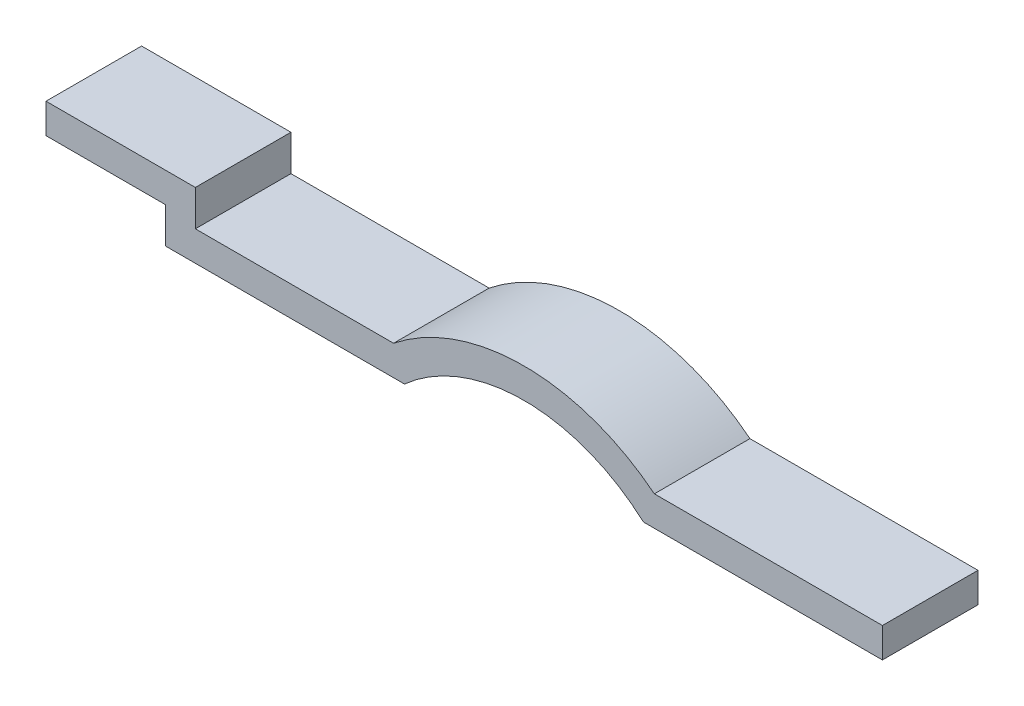
ISO-10303-21;
HEADER;
FILE_DESCRIPTION(('STEP AP214'),'2;1');
FILE_NAME('part.step','',(''),(''),'','','');
FILE_SCHEMA(('AUTOMOTIVE_DESIGN { 1 0 10303 214 1 1 1 1 }'));
ENDSEC;
DATA;
#1=APPLICATION_CONTEXT('core data for automotive mechanical design processes');
#2=APPLICATION_PROTOCOL_DEFINITION('international standard','automotive_design',2000,#1);
#3=PRODUCT_CONTEXT('',#1,'mechanical');
#4=PRODUCT('Part','Part','',(#3));
#5=PRODUCT_RELATED_PRODUCT_CATEGORY('part','',(#4));
#6=PRODUCT_DEFINITION_FORMATION('','',#4);
#7=PRODUCT_DEFINITION_CONTEXT('part definition',#1,'design');
#8=PRODUCT_DEFINITION('design','',#6,#7);
#9=PRODUCT_DEFINITION_SHAPE('','',#8);
#10=(LENGTH_UNIT() NAMED_UNIT(*) SI_UNIT(.MILLI.,.METRE.));
#11=(NAMED_UNIT(*) PLANE_ANGLE_UNIT() SI_UNIT($,.RADIAN.));
#12=(NAMED_UNIT(*) SI_UNIT($,.STERADIAN.) SOLID_ANGLE_UNIT());
#13=UNCERTAINTY_MEASURE_WITH_UNIT(LENGTH_MEASURE(1.E-05),#10,'distance_accuracy_value','');
#14=(GEOMETRIC_REPRESENTATION_CONTEXT(3) GLOBAL_UNCERTAINTY_ASSIGNED_CONTEXT((#13)) GLOBAL_UNIT_ASSIGNED_CONTEXT((#10,
#11,#12)) REPRESENTATION_CONTEXT('',''));
#15=CARTESIAN_POINT('',(0.,0.,0.));
#16=DIRECTION('',(0.,0.,1.));
#17=DIRECTION('',(1.,0.,0.));
#18=AXIS2_PLACEMENT_3D('',#15,#16,#17);
#19=CARTESIAN_POINT('',(0.,25.,80.));
#20=DIRECTION('',(-1.,0.,0.));
#21=DIRECTION('',(0.,-1.,0.));
#22=AXIS2_PLACEMENT_3D('',#19,#20,#21);
#23=PLANE('',#22);
#24=DIRECTION('',(0.,1.,0.));
#25=VECTOR('',#24,1.);
#26=CARTESIAN_POINT('',(0.,25.,0.));
#27=LINE('',#26,#25);
#28=CARTESIAN_POINT('',(0.,0.,0.));
#29=VERTEX_POINT('',#28);
#30=CARTESIAN_POINT('',(0.,25.,0.));
#31=VERTEX_POINT('',#30);
#32=EDGE_CURVE('E161',#29,#31,#27,.T.);
#33=ORIENTED_EDGE('',*,*,#32,.T.);
#34=DIRECTION('',(0.,0.,-1.));
#35=VECTOR('',#34,1.);
#36=CARTESIAN_POINT('',(0.,25.,80.));
#37=LINE('',#36,#35);
#38=CARTESIAN_POINT('',(0.,25.,80.));
#39=VERTEX_POINT('',#38);
#40=EDGE_CURVE('E11',#39,#31,#37,.T.);
#41=ORIENTED_EDGE('',*,*,#40,.F.);
#42=DIRECTION('',(0.,1.,0.));
#43=VECTOR('',#42,1.);
#44=CARTESIAN_POINT('',(0.,25.,80.));
#45=LINE('',#44,#43);
#46=CARTESIAN_POINT('',(0.,0.,80.));
#47=VERTEX_POINT('',#46);
#48=EDGE_CURVE('E183',#47,#39,#45,.T.);
#49=ORIENTED_EDGE('',*,*,#48,.F.);
#50=DIRECTION('',(0.,0.,-1.));
#51=VECTOR('',#50,1.);
#52=CARTESIAN_POINT('',(0.,0.,80.));
#53=LINE('',#52,#51);
#54=EDGE_CURVE('E157',#47,#29,#53,.T.);
#55=ORIENTED_EDGE('',*,*,#54,.T.);
#56=EDGE_LOOP('',(#33,#41,#49,#55));
#57=FACE_BOUND('',#56,.T.);
#58=ADVANCED_FACE('F41',(#57),#23,.F.);
#59=CARTESIAN_POINT('',(0.,25.,80.));
#60=DIRECTION('',(0.,-1.,0.));
#61=DIRECTION('',(1.,0.,0.));
#62=AXIS2_PLACEMENT_3D('',#59,#60,#61);
#63=PLANE('',#62);
#64=DIRECTION('',(-1.,0.,0.));
#65=VECTOR('',#64,1.);
#66=CARTESIAN_POINT('',(0.,25.,0.));
#67=LINE('',#66,#65);
#68=CARTESIAN_POINT('',(-190.867832165532,25.,0.));
#69=VERTEX_POINT('',#68);
#70=EDGE_CURVE('E164',#31,#69,#67,.T.);
#71=ORIENTED_EDGE('',*,*,#70,.T.);
#72=DIRECTION('',(0.,0.,-1.));
#73=VECTOR('',#72,1.);
#74=CARTESIAN_POINT('',(-190.867832165532,25.,80.));
#75=LINE('',#74,#73);
#76=CARTESIAN_POINT('',(-190.867832165532,25.,80.));
#77=VERTEX_POINT('',#76);
#78=EDGE_CURVE('E49',#77,#69,#75,.T.);
#79=ORIENTED_EDGE('',*,*,#78,.F.);
#80=DIRECTION('',(-1.,0.,0.));
#81=VECTOR('',#80,1.);
#82=CARTESIAN_POINT('',(0.,25.,80.));
#83=LINE('',#82,#81);
#84=EDGE_CURVE('E112',#39,#77,#83,.T.);
#85=ORIENTED_EDGE('',*,*,#84,.F.);
#86=ORIENTED_EDGE('',*,*,#40,.T.);
#87=EDGE_LOOP('',(#71,#79,#85,#86));
#88=FACE_BOUND('',#87,.T.);
#89=ADVANCED_FACE('F261',(#88),#63,.F.);
#90=CARTESIAN_POINT('',(-300.,-111.803398874989,80.));
#91=DIRECTION('',(0.,0.,-1.));
#92=DIRECTION('',(-1.,0.,0.));
#93=AXIS2_PLACEMENT_3D('',#90,#91,#92);
#94=CYLINDRICAL_SURFACE('',#93,175.);
#95=CARTESIAN_POINT('',(-300.,-111.803398874989,0.));
#96=DIRECTION('',(0.,0.,1.));
#97=DIRECTION('',(-1.,0.,0.));
#98=AXIS2_PLACEMENT_3D('',#95,#96,#97);
#99=CIRCLE('',#98,175.);
#100=CARTESIAN_POINT('',(-409.132167834468,25.,0.));
#101=VERTEX_POINT('',#100);
#102=EDGE_CURVE('E166',#69,#101,#99,.T.);
#103=ORIENTED_EDGE('',*,*,#102,.T.);
#104=DIRECTION('',(0.,0.,-1.));
#105=VECTOR('',#104,1.);
#106=CARTESIAN_POINT('',(-409.132167834468,25.,80.));
#107=LINE('',#106,#105);
#108=CARTESIAN_POINT('',(-409.132167834468,25.,80.));
#109=VERTEX_POINT('',#108);
#110=EDGE_CURVE('E202',#109,#101,#107,.T.);
#111=ORIENTED_EDGE('',*,*,#110,.F.);
#112=CARTESIAN_POINT('',(-300.,-111.803398874989,80.));
#113=DIRECTION('',(0.,0.,1.));
#114=DIRECTION('',(-1.,0.,0.));
#115=AXIS2_PLACEMENT_3D('',#112,#113,#114);
#116=CIRCLE('',#115,175.);
#117=EDGE_CURVE('E210',#77,#109,#116,.T.);
#118=ORIENTED_EDGE('',*,*,#117,.F.);
#119=ORIENTED_EDGE('',*,*,#78,.T.);
#120=EDGE_LOOP('',(#103,#111,#118,#119));
#121=FACE_BOUND('',#120,.T.);
#122=ADVANCED_FACE('F208',(#121),#94,.T.);
#123=CARTESIAN_POINT('',(-409.132167834468,25.,80.));
#124=DIRECTION('',(0.,-1.,0.));
#125=DIRECTION('',(1.,0.,0.));
#126=AXIS2_PLACEMENT_3D('',#123,#124,#125);
#127=PLANE('',#126);
#128=DIRECTION('',(-1.,0.,0.));
#129=VECTOR('',#128,1.);
#130=CARTESIAN_POINT('',(-409.132167834468,25.,0.));
#131=LINE('',#130,#129);
#132=CARTESIAN_POINT('',(-575.,25.,0.));
#133=VERTEX_POINT('',#132);
#134=EDGE_CURVE('E168',#101,#133,#131,.T.);
#135=ORIENTED_EDGE('',*,*,#134,.T.);
#136=DIRECTION('',(0.,0.,-1.));
#137=VECTOR('',#136,1.);
#138=CARTESIAN_POINT('',(-575.,25.,80.));
#139=LINE('',#138,#137);
#140=CARTESIAN_POINT('',(-575.,25.,80.));
#141=VERTEX_POINT('',#140);
#142=EDGE_CURVE('E199',#141,#133,#139,.T.);
#143=ORIENTED_EDGE('',*,*,#142,.F.);
#144=DIRECTION('',(-1.,0.,0.));
#145=VECTOR('',#144,1.);
#146=CARTESIAN_POINT('',(-409.132167834468,25.,80.));
#147=LINE('',#146,#145);
#148=EDGE_CURVE('E228',#109,#141,#147,.T.);
#149=ORIENTED_EDGE('',*,*,#148,.F.);
#150=ORIENTED_EDGE('',*,*,#110,.T.);
#151=EDGE_LOOP('',(#135,#143,#149,#150));
#152=FACE_BOUND('',#151,.T.);
#153=ADVANCED_FACE('F219',(#152),#127,.F.);
#154=CARTESIAN_POINT('',(-575.,25.,80.));
#155=DIRECTION('',(-1.,0.,0.));
#156=DIRECTION('',(0.,0.,1.));
#157=AXIS2_PLACEMENT_3D('',#154,#155,#156);
#158=PLANE('',#157);
#159=DIRECTION('',(0.,1.,0.));
#160=VECTOR('',#159,1.);
#161=CARTESIAN_POINT('',(-575.,25.,0.));
#162=LINE('',#161,#160);
#163=CARTESIAN_POINT('',(-575.,55.,0.));
#164=VERTEX_POINT('',#163);
#165=EDGE_CURVE('E170',#133,#164,#162,.T.);
#166=ORIENTED_EDGE('',*,*,#165,.T.);
#167=DIRECTION('',(0.,0.,-1.));
#168=VECTOR('',#167,1.);
#169=CARTESIAN_POINT('',(-575.,55.,80.));
#170=LINE('',#169,#168);
#171=CARTESIAN_POINT('',(-575.,55.,80.));
#172=VERTEX_POINT('',#171);
#173=EDGE_CURVE('E196',#172,#164,#170,.T.);
#174=ORIENTED_EDGE('',*,*,#173,.F.);
#175=DIRECTION('',(0.,1.,0.));
#176=VECTOR('',#175,1.);
#177=CARTESIAN_POINT('',(-575.,25.,80.));
#178=LINE('',#177,#176);
#179=EDGE_CURVE('E225',#141,#172,#178,.T.);
#180=ORIENTED_EDGE('',*,*,#179,.F.);
#181=ORIENTED_EDGE('',*,*,#142,.T.);
#182=EDGE_LOOP('',(#166,#174,#180,#181));
#183=FACE_BOUND('',#182,.T.);
#184=ADVANCED_FACE('F223',(#183),#158,.F.);
#185=CARTESIAN_POINT('',(-575.,55.,80.));
#186=DIRECTION('',(0.,-1.,0.));
#187=DIRECTION('',(1.,0.,0.));
#188=AXIS2_PLACEMENT_3D('',#185,#186,#187);
#189=PLANE('',#188);
#190=DIRECTION('',(-1.,0.,0.));
#191=VECTOR('',#190,1.);
#192=CARTESIAN_POINT('',(-575.,55.,0.));
#193=LINE('',#192,#191);
#194=CARTESIAN_POINT('',(-700.,55.,0.));
#195=VERTEX_POINT('',#194);
#196=EDGE_CURVE('E172',#164,#195,#193,.T.);
#197=ORIENTED_EDGE('',*,*,#196,.T.);
#198=DIRECTION('',(0.,0.,-1.));
#199=VECTOR('',#198,1.);
#200=CARTESIAN_POINT('',(-700.,55.,80.));
#201=LINE('',#200,#199);
#202=CARTESIAN_POINT('',(-700.,55.,80.));
#203=VERTEX_POINT('',#202);
#204=EDGE_CURVE('E193',#203,#195,#201,.T.);
#205=ORIENTED_EDGE('',*,*,#204,.F.);
#206=DIRECTION('',(-1.,0.,0.));
#207=VECTOR('',#206,1.);
#208=CARTESIAN_POINT('',(-575.,55.,80.));
#209=LINE('',#208,#207);
#210=EDGE_CURVE('E227',#172,#203,#209,.T.);
#211=ORIENTED_EDGE('',*,*,#210,.F.);
#212=ORIENTED_EDGE('',*,*,#173,.T.);
#213=EDGE_LOOP('',(#197,#205,#211,#212));
#214=FACE_BOUND('',#213,.T.);
#215=ADVANCED_FACE('F274',(#214),#189,.F.);
#216=CARTESIAN_POINT('',(-700.,30.,80.));
#217=DIRECTION('',(1.,0.,0.));
#218=DIRECTION('',(0.,0.,-1.));
#219=AXIS2_PLACEMENT_3D('',#216,#217,#218);
#220=PLANE('',#219);
#221=DIRECTION('',(0.,-1.,0.));
#222=VECTOR('',#221,1.);
#223=CARTESIAN_POINT('',(-700.,30.,0.));
#224=LINE('',#223,#222);
#225=CARTESIAN_POINT('',(-700.,30.,0.));
#226=VERTEX_POINT('',#225);
#227=EDGE_CURVE('E174',#195,#226,#224,.T.);
#228=ORIENTED_EDGE('',*,*,#227,.T.);
#229=DIRECTION('',(0.,0.,-1.));
#230=VECTOR('',#229,1.);
#231=CARTESIAN_POINT('',(-700.,30.,80.));
#232=LINE('',#231,#230);
#233=CARTESIAN_POINT('',(-700.,30.,80.));
#234=VERTEX_POINT('',#233);
#235=EDGE_CURVE('E190',#234,#226,#232,.T.);
#236=ORIENTED_EDGE('',*,*,#235,.F.);
#237=DIRECTION('',(0.,-1.,0.));
#238=VECTOR('',#237,1.);
#239=CARTESIAN_POINT('',(-700.,30.,80.));
#240=LINE('',#239,#238);
#241=EDGE_CURVE('E230',#203,#234,#240,.T.);
#242=ORIENTED_EDGE('',*,*,#241,.F.);
#243=ORIENTED_EDGE('',*,*,#204,.T.);
#244=EDGE_LOOP('',(#228,#236,#242,#243));
#245=FACE_BOUND('',#244,.T.);
#246=ADVANCED_FACE('F277',(#245),#220,.F.);
#247=CARTESIAN_POINT('',(-600.,30.,80.));
#248=DIRECTION('',(0.,1.,0.));
#249=DIRECTION('',(-1.,0.,0.));
#250=AXIS2_PLACEMENT_3D('',#247,#248,#249);
#251=PLANE('',#250);
#252=DIRECTION('',(1.,0.,0.));
#253=VECTOR('',#252,1.);
#254=CARTESIAN_POINT('',(-600.,30.,0.));
#255=LINE('',#254,#253);
#256=CARTESIAN_POINT('',(-600.,30.,0.));
#257=VERTEX_POINT('',#256);
#258=EDGE_CURVE('E176',#226,#257,#255,.T.);
#259=ORIENTED_EDGE('',*,*,#258,.T.);
#260=DIRECTION('',(0.,0.,-1.));
#261=VECTOR('',#260,1.);
#262=CARTESIAN_POINT('',(-600.,30.,80.));
#263=LINE('',#262,#261);
#264=CARTESIAN_POINT('',(-600.,30.,80.));
#265=VERTEX_POINT('',#264);
#266=EDGE_CURVE('E187',#265,#257,#263,.T.);
#267=ORIENTED_EDGE('',*,*,#266,.F.);
#268=DIRECTION('',(1.,0.,0.));
#269=VECTOR('',#268,1.);
#270=CARTESIAN_POINT('',(-600.,30.,80.));
#271=LINE('',#270,#269);
#272=EDGE_CURVE('E236',#234,#265,#271,.T.);
#273=ORIENTED_EDGE('',*,*,#272,.F.);
#274=ORIENTED_EDGE('',*,*,#235,.T.);
#275=EDGE_LOOP('',(#259,#267,#273,#274));
#276=FACE_BOUND('',#275,.T.);
#277=ADVANCED_FACE('F242',(#276),#251,.F.);
#278=CARTESIAN_POINT('',(-600.,0.,80.));
#279=DIRECTION('',(1.,0.,0.));
#280=DIRECTION('',(0.,0.,-1.));
#281=AXIS2_PLACEMENT_3D('',#278,#279,#280);
#282=PLANE('',#281);
#283=DIRECTION('',(0.,-1.,0.));
#284=VECTOR('',#283,1.);
#285=CARTESIAN_POINT('',(-600.,0.,0.));
#286=LINE('',#285,#284);
#287=CARTESIAN_POINT('',(-600.,0.,0.));
#288=VERTEX_POINT('',#287);
#289=EDGE_CURVE('E178',#257,#288,#286,.T.);
#290=ORIENTED_EDGE('',*,*,#289,.T.);
#291=DIRECTION('',(0.,0.,-1.));
#292=VECTOR('',#291,1.);
#293=CARTESIAN_POINT('',(-600.,0.,80.));
#294=LINE('',#293,#292);
#295=CARTESIAN_POINT('',(-600.,0.,80.));
#296=VERTEX_POINT('',#295);
#297=EDGE_CURVE('E152',#296,#288,#294,.T.);
#298=ORIENTED_EDGE('',*,*,#297,.F.);
#299=DIRECTION('',(0.,-1.,0.));
#300=VECTOR('',#299,1.);
#301=CARTESIAN_POINT('',(-600.,0.,80.));
#302=LINE('',#301,#300);
#303=EDGE_CURVE('E143',#265,#296,#302,.T.);
#304=ORIENTED_EDGE('',*,*,#303,.F.);
#305=ORIENTED_EDGE('',*,*,#266,.T.);
#306=EDGE_LOOP('',(#290,#298,#304,#305));
#307=FACE_BOUND('',#306,.T.);
#308=ADVANCED_FACE('F246',(#307),#282,.F.);
#309=CARTESIAN_POINT('',(-400.,0.,80.));
#310=DIRECTION('',(0.,1.,0.));
#311=DIRECTION('',(-1.,0.,0.));
#312=AXIS2_PLACEMENT_3D('',#309,#310,#311);
#313=PLANE('',#312);
#314=DIRECTION('',(1.,0.,0.));
#315=VECTOR('',#314,1.);
#316=CARTESIAN_POINT('',(-400.,0.,0.));
#317=LINE('',#316,#315);
#318=CARTESIAN_POINT('',(-400.,0.,0.));
#319=VERTEX_POINT('',#318);
#320=EDGE_CURVE('E151',#288,#319,#317,.T.);
#321=ORIENTED_EDGE('',*,*,#320,.T.);
#322=DIRECTION('',(0.,0.,-1.));
#323=VECTOR('',#322,1.);
#324=CARTESIAN_POINT('',(-400.,0.,80.));
#325=LINE('',#324,#323);
#326=CARTESIAN_POINT('',(-400.,0.,80.));
#327=VERTEX_POINT('',#326);
#328=EDGE_CURVE('E148',#327,#319,#325,.T.);
#329=ORIENTED_EDGE('',*,*,#328,.F.);
#330=DIRECTION('',(1.,0.,0.));
#331=VECTOR('',#330,1.);
#332=CARTESIAN_POINT('',(-400.,0.,80.));
#333=LINE('',#332,#331);
#334=EDGE_CURVE('E137',#296,#327,#333,.T.);
#335=ORIENTED_EDGE('',*,*,#334,.F.);
#336=ORIENTED_EDGE('',*,*,#297,.T.);
#337=EDGE_LOOP('',(#321,#329,#335,#336));
#338=FACE_BOUND('',#337,.T.);
#339=ADVANCED_FACE('F149',(#338),#313,.F.);
#340=CARTESIAN_POINT('',(-300.,-111.803398874989,80.));
#341=DIRECTION('',(0.,0.,-1.));
#342=DIRECTION('',(-1.,0.,0.));
#343=AXIS2_PLACEMENT_3D('',#340,#341,#342);
#344=CYLINDRICAL_SURFACE('',#343,150.);
#345=CARTESIAN_POINT('',(-300.,-111.803398874989,0.));
#346=DIRECTION('',(0.,0.,-1.));
#347=DIRECTION('',(-1.,0.,0.));
#348=AXIS2_PLACEMENT_3D('',#345,#346,#347);
#349=CIRCLE('',#348,150.);
#350=CARTESIAN_POINT('',(-200.,0.,0.));
#351=VERTEX_POINT('',#350);
#352=EDGE_CURVE('E98',#319,#351,#349,.T.);
#353=ORIENTED_EDGE('',*,*,#352,.T.);
#354=DIRECTION('',(0.,0.,-1.));
#355=VECTOR('',#354,1.);
#356=CARTESIAN_POINT('',(-200.,0.,80.));
#357=LINE('',#356,#355);
#358=CARTESIAN_POINT('',(-200.,0.,80.));
#359=VERTEX_POINT('',#358);
#360=EDGE_CURVE('E153',#359,#351,#357,.T.);
#361=ORIENTED_EDGE('',*,*,#360,.F.);
#362=CARTESIAN_POINT('',(-300.,-111.803398874989,80.));
#363=DIRECTION('',(0.,0.,-1.));
#364=DIRECTION('',(-1.,0.,0.));
#365=AXIS2_PLACEMENT_3D('',#362,#363,#364);
#366=CIRCLE('',#365,150.);
#367=EDGE_CURVE('E141',#327,#359,#366,.T.);
#368=ORIENTED_EDGE('',*,*,#367,.F.);
#369=ORIENTED_EDGE('',*,*,#328,.T.);
#370=EDGE_LOOP('',(#353,#361,#368,#369));
#371=FACE_BOUND('',#370,.T.);
#372=ADVANCED_FACE('F155',(#371),#344,.F.);
#373=CARTESIAN_POINT('',(0.,0.,80.));
#374=DIRECTION('',(0.,1.,0.));
#375=DIRECTION('',(0.,0.,1.));
#376=AXIS2_PLACEMENT_3D('',#373,#374,#375);
#377=PLANE('',#376);
#378=DIRECTION('',(1.,0.,0.));
#379=VECTOR('',#378,1.);
#380=CARTESIAN_POINT('',(0.,0.,0.));
#381=LINE('',#380,#379);
#382=EDGE_CURVE('E104',#351,#29,#381,.T.);
#383=ORIENTED_EDGE('',*,*,#382,.T.);
#384=ORIENTED_EDGE('',*,*,#54,.F.);
#385=DIRECTION('',(1.,0.,0.));
#386=VECTOR('',#385,1.);
#387=CARTESIAN_POINT('',(0.,0.,80.));
#388=LINE('',#387,#386);
#389=EDGE_CURVE('E57',#359,#47,#388,.T.);
#390=ORIENTED_EDGE('',*,*,#389,.F.);
#391=ORIENTED_EDGE('',*,*,#360,.T.);
#392=EDGE_LOOP('',(#383,#384,#390,#391));
#393=FACE_BOUND('',#392,.T.);
#394=ADVANCED_FACE('F250',(#393),#377,.F.);
#395=CARTESIAN_POINT('',(-300.,-111.803398874989,80.));
#396=DIRECTION('',(0.,0.,-1.));
#397=DIRECTION('',(-1.,0.,0.));
#398=AXIS2_PLACEMENT_3D('',#395,#396,#397);
#399=PLANE('',#398);
#400=ORIENTED_EDGE('',*,*,#48,.T.);
#401=ORIENTED_EDGE('',*,*,#84,.T.);
#402=ORIENTED_EDGE('',*,*,#117,.T.);
#403=ORIENTED_EDGE('',*,*,#148,.T.);
#404=ORIENTED_EDGE('',*,*,#179,.T.);
#405=ORIENTED_EDGE('',*,*,#210,.T.);
#406=ORIENTED_EDGE('',*,*,#241,.T.);
#407=ORIENTED_EDGE('',*,*,#272,.T.);
#408=ORIENTED_EDGE('',*,*,#303,.T.);
#409=ORIENTED_EDGE('',*,*,#334,.T.);
#410=ORIENTED_EDGE('',*,*,#367,.T.);
#411=ORIENTED_EDGE('',*,*,#389,.T.);
#412=EDGE_LOOP('',(#400,#401,#402,#403,#404,#405,#406,#407,#408,#409,#410,#411));
#413=FACE_BOUND('',#412,.T.);
#414=ADVANCED_FACE('F139',(#413),#399,.F.);
#415=CARTESIAN_POINT('',(-300.,-111.803398874989,0.));
#416=DIRECTION('',(0.,0.,-1.));
#417=DIRECTION('',(-1.,0.,0.));
#418=AXIS2_PLACEMENT_3D('',#415,#416,#417);
#419=PLANE('',#418);
#420=ORIENTED_EDGE('',*,*,#32,.F.);
#421=ORIENTED_EDGE('',*,*,#382,.F.);
#422=ORIENTED_EDGE('',*,*,#352,.F.);
#423=ORIENTED_EDGE('',*,*,#320,.F.);
#424=ORIENTED_EDGE('',*,*,#289,.F.);
#425=ORIENTED_EDGE('',*,*,#258,.F.);
#426=ORIENTED_EDGE('',*,*,#227,.F.);
#427=ORIENTED_EDGE('',*,*,#196,.F.);
#428=ORIENTED_EDGE('',*,*,#165,.F.);
#429=ORIENTED_EDGE('',*,*,#134,.F.);
#430=ORIENTED_EDGE('',*,*,#102,.F.);
#431=ORIENTED_EDGE('',*,*,#70,.F.);
#432=EDGE_LOOP('',(#420,#421,#422,#423,#424,#425,#426,#427,#428,#429,#430,#431));
#433=FACE_BOUND('',#432,.T.);
#434=ADVANCED_FACE('F214',(#433),#419,.T.);
#435=CLOSED_SHELL('',(#58,#89,#122,#153,#184,#215,#246,#277,#308,#339,#372,#394,#414,#434));
#436=MANIFOLD_SOLID_BREP('B2',#435);
#437=ADVANCED_BREP_SHAPE_REPRESENTATION('',(#18,#436),#14);
#438=SHAPE_DEFINITION_REPRESENTATION(#9,#437);
ENDSEC;
END-ISO-10303-21;
